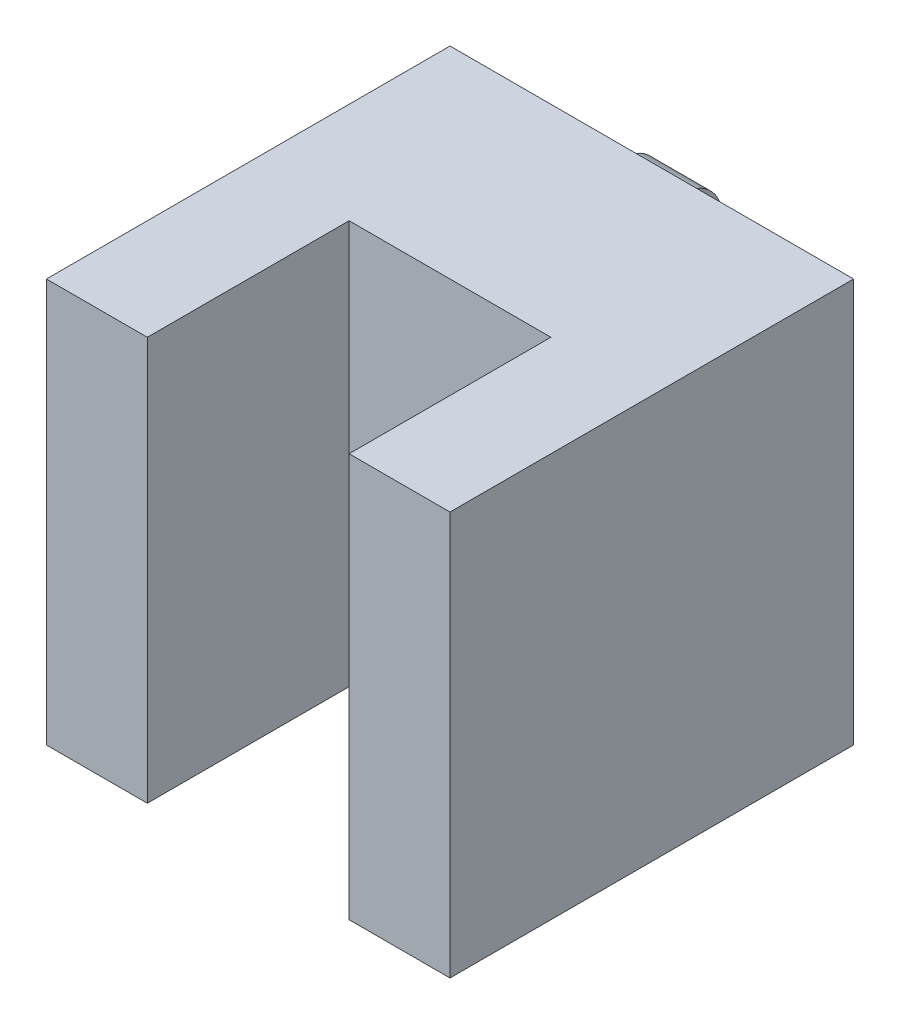
ISO-10303-21;
HEADER;
FILE_DESCRIPTION(('STEP AP214'),'2;1');
FILE_NAME('part.step','',(''),(''),'','','');
FILE_SCHEMA(('AUTOMOTIVE_DESIGN { 1 0 10303 214 1 1 1 1 }'));
ENDSEC;
DATA;
#1=APPLICATION_CONTEXT('core data for automotive mechanical design processes');
#2=APPLICATION_PROTOCOL_DEFINITION('international standard','automotive_design',2000,#1);
#3=PRODUCT_CONTEXT('',#1,'mechanical');
#4=PRODUCT('Part','Part','',(#3));
#5=PRODUCT_RELATED_PRODUCT_CATEGORY('part','',(#4));
#6=PRODUCT_DEFINITION_FORMATION('','',#4);
#7=PRODUCT_DEFINITION_CONTEXT('part definition',#1,'design');
#8=PRODUCT_DEFINITION('design','',#6,#7);
#9=PRODUCT_DEFINITION_SHAPE('','',#8);
#10=(LENGTH_UNIT() NAMED_UNIT(*) SI_UNIT(.MILLI.,.METRE.));
#11=(NAMED_UNIT(*) PLANE_ANGLE_UNIT() SI_UNIT($,.RADIAN.));
#12=(NAMED_UNIT(*) SI_UNIT($,.STERADIAN.) SOLID_ANGLE_UNIT());
#13=UNCERTAINTY_MEASURE_WITH_UNIT(LENGTH_MEASURE(1.E-05),#10,'distance_accuracy_value','');
#14=(GEOMETRIC_REPRESENTATION_CONTEXT(3) GLOBAL_UNCERTAINTY_ASSIGNED_CONTEXT((#13)) GLOBAL_UNIT_ASSIGNED_CONTEXT((#10,
#11,#12)) REPRESENTATION_CONTEXT('',''));
#15=CARTESIAN_POINT('',(0.,0.,0.));
#16=DIRECTION('',(0.,0.,1.));
#17=DIRECTION('',(1.,0.,0.));
#18=AXIS2_PLACEMENT_3D('',#15,#16,#17);
#19=CARTESIAN_POINT('',(-5.,20.,-20.));
#20=DIRECTION('',(0.,0.,1.));
#21=DIRECTION('',(1.,0.,0.));
#22=AXIS2_PLACEMENT_3D('',#19,#20,#21);
#23=PLANE('',#22);
#24=DIRECTION('',(0.,-1.,0.));
#25=VECTOR('',#24,1.);
#26=CARTESIAN_POINT('',(3.5,18.9127443644208,-20.));
#27=LINE('',#26,#25);
#28=CARTESIAN_POINT('',(3.5,19.4127443644208,-20.));
#29=VERTEX_POINT('',#28);
#30=CARTESIAN_POINT('',(3.5,18.9127443644208,-20.));
#31=VERTEX_POINT('',#30);
#32=EDGE_CURVE('E137',#29,#31,#27,.T.);
#33=ORIENTED_EDGE('',*,*,#32,.T.);
#34=DIRECTION('',(1.,0.,0.));
#35=VECTOR('',#34,1.);
#36=CARTESIAN_POINT('',(3.5,18.9127443644208,-20.));
#37=LINE('',#36,#35);
#38=CARTESIAN_POINT('',(6.5,18.9127443644208,-20.));
#39=VERTEX_POINT('',#38);
#40=EDGE_CURVE('E128',#31,#39,#37,.T.);
#41=ORIENTED_EDGE('',*,*,#40,.T.);
#42=DIRECTION('',(0.,-1.,0.));
#43=VECTOR('',#42,1.);
#44=CARTESIAN_POINT('',(6.5,18.9127443644208,-20.));
#45=LINE('',#44,#43);
#46=CARTESIAN_POINT('',(6.5,19.4127443644208,-20.));
#47=VERTEX_POINT('',#46);
#48=EDGE_CURVE('E120',#47,#39,#45,.T.);
#49=ORIENTED_EDGE('',*,*,#48,.F.);
#50=DIRECTION('',(1.,0.,0.));
#51=VECTOR('',#50,1.);
#52=CARTESIAN_POINT('',(3.5,19.4127443644208,-20.));
#53=LINE('',#52,#51);
#54=EDGE_CURVE('E138',#29,#47,#53,.T.);
#55=ORIENTED_EDGE('',*,*,#54,.F.);
#56=EDGE_LOOP('',(#33,#41,#49,#55));
#57=FACE_BOUND('',#56,.T.);
#58=DIRECTION('',(-1.,0.,0.));
#59=VECTOR('',#58,1.);
#60=CARTESIAN_POINT('',(-5.,0.,-20.));
#61=LINE('',#60,#59);
#62=CARTESIAN_POINT('',(15.,0.,-20.));
#63=VERTEX_POINT('',#62);
#64=CARTESIAN_POINT('',(-5.,0.,-20.));
#65=VERTEX_POINT('',#64);
#66=EDGE_CURVE('E178',#63,#65,#61,.T.);
#67=ORIENTED_EDGE('',*,*,#66,.T.);
#68=DIRECTION('',(0.,-1.,0.));
#69=VECTOR('',#68,1.);
#70=CARTESIAN_POINT('',(-5.,20.,-20.));
#71=LINE('',#70,#69);
#72=CARTESIAN_POINT('',(-5.,20.,-20.));
#73=VERTEX_POINT('',#72);
#74=EDGE_CURVE('E183',#73,#65,#71,.T.);
#75=ORIENTED_EDGE('',*,*,#74,.F.);
#76=DIRECTION('',(-1.,0.,0.));
#77=VECTOR('',#76,1.);
#78=CARTESIAN_POINT('',(-5.,20.,-20.));
#79=LINE('',#78,#77);
#80=CARTESIAN_POINT('',(15.,20.,-20.));
#81=VERTEX_POINT('',#80);
#82=EDGE_CURVE('E160',#81,#73,#79,.T.);
#83=ORIENTED_EDGE('',*,*,#82,.F.);
#84=DIRECTION('',(0.,-1.,0.));
#85=VECTOR('',#84,1.);
#86=CARTESIAN_POINT('',(15.,20.,-20.));
#87=LINE('',#86,#85);
#88=EDGE_CURVE('E186',#81,#63,#87,.T.);
#89=ORIENTED_EDGE('',*,*,#88,.T.);
#90=EDGE_LOOP('',(#67,#75,#83,#89));
#91=FACE_BOUND('',#90,.T.);
#92=DIRECTION('',(0.,-1.,0.));
#93=VECTOR('',#92,1.);
#94=CARTESIAN_POINT('',(3.5,15.9127443644208,-20.));
#95=LINE('',#94,#93);
#96=CARTESIAN_POINT('',(3.5,15.9127443644208,-20.));
#97=VERTEX_POINT('',#96);
#98=CARTESIAN_POINT('',(3.5,15.4127443644208,-20.));
#99=VERTEX_POINT('',#98);
#100=EDGE_CURVE('E142',#97,#99,#95,.T.);
#101=ORIENTED_EDGE('',*,*,#100,.T.);
#102=DIRECTION('',(1.,0.,0.));
#103=VECTOR('',#102,1.);
#104=CARTESIAN_POINT('',(3.5,15.4127443644208,-20.));
#105=LINE('',#104,#103);
#106=CARTESIAN_POINT('',(6.5,15.4127443644208,-20.));
#107=VERTEX_POINT('',#106);
#108=EDGE_CURVE('E140',#99,#107,#105,.T.);
#109=ORIENTED_EDGE('',*,*,#108,.T.);
#110=DIRECTION('',(0.,-1.,0.));
#111=VECTOR('',#110,1.);
#112=CARTESIAN_POINT('',(6.5,15.9127443644208,-20.));
#113=LINE('',#112,#111);
#114=CARTESIAN_POINT('',(6.5,15.9127443644208,-20.));
#115=VERTEX_POINT('',#114);
#116=EDGE_CURVE('E133',#115,#107,#113,.T.);
#117=ORIENTED_EDGE('',*,*,#116,.F.);
#118=DIRECTION('',(1.,0.,0.));
#119=VECTOR('',#118,1.);
#120=CARTESIAN_POINT('',(3.5,15.9127443644208,-20.));
#121=LINE('',#120,#119);
#122=EDGE_CURVE('E131',#97,#115,#121,.T.);
#123=ORIENTED_EDGE('',*,*,#122,.F.);
#124=EDGE_LOOP('',(#101,#109,#117,#123));
#125=FACE_BOUND('',#124,.T.);
#126=ADVANCED_FACE('F34',(#57,#91,#125),#23,.F.);
#127=CARTESIAN_POINT('',(0.,20.,0.));
#128=DIRECTION('',(0.,0.,-1.));
#129=DIRECTION('',(-1.,0.,0.));
#130=AXIS2_PLACEMENT_3D('',#127,#128,#129);
#131=PLANE('',#130);
#132=DIRECTION('',(1.,0.,0.));
#133=VECTOR('',#132,1.);
#134=CARTESIAN_POINT('',(0.,0.,0.));
#135=LINE('',#134,#133);
#136=CARTESIAN_POINT('',(-5.,0.,0.));
#137=VERTEX_POINT('',#136);
#138=CARTESIAN_POINT('',(0.,0.,0.));
#139=VERTEX_POINT('',#138);
#140=EDGE_CURVE('E165',#137,#139,#135,.T.);
#141=ORIENTED_EDGE('',*,*,#140,.T.);
#142=DIRECTION('',(0.,-1.,0.));
#143=VECTOR('',#142,1.);
#144=CARTESIAN_POINT('',(0.,20.,0.));
#145=LINE('',#144,#143);
#146=CARTESIAN_POINT('',(0.,20.,0.));
#147=VERTEX_POINT('',#146);
#148=EDGE_CURVE('E11',#147,#139,#145,.T.);
#149=ORIENTED_EDGE('',*,*,#148,.F.);
#150=DIRECTION('',(1.,0.,0.));
#151=VECTOR('',#150,1.);
#152=CARTESIAN_POINT('',(0.,20.,0.));
#153=LINE('',#152,#151);
#154=CARTESIAN_POINT('',(-5.,20.,0.));
#155=VERTEX_POINT('',#154);
#156=EDGE_CURVE('E146',#155,#147,#153,.T.);
#157=ORIENTED_EDGE('',*,*,#156,.F.);
#158=DIRECTION('',(0.,-1.,0.));
#159=VECTOR('',#158,1.);
#160=CARTESIAN_POINT('',(-5.,20.,0.));
#161=LINE('',#160,#159);
#162=EDGE_CURVE('E164',#155,#137,#161,.T.);
#163=ORIENTED_EDGE('',*,*,#162,.T.);
#164=EDGE_LOOP('',(#141,#149,#157,#163));
#165=FACE_BOUND('',#164,.T.);
#166=ADVANCED_FACE('F36',(#165),#131,.F.);
#167=CARTESIAN_POINT('',(0.,20.,0.));
#168=DIRECTION('',(-1.,0.,0.));
#169=DIRECTION('',(0.,0.,1.));
#170=AXIS2_PLACEMENT_3D('',#167,#168,#169);
#171=PLANE('',#170);
#172=DIRECTION('',(0.,0.,-1.));
#173=VECTOR('',#172,1.);
#174=CARTESIAN_POINT('',(0.,0.,0.));
#175=LINE('',#174,#173);
#176=CARTESIAN_POINT('',(0.,0.,-10.));
#177=VERTEX_POINT('',#176);
#178=EDGE_CURVE('E168',#139,#177,#175,.T.);
#179=ORIENTED_EDGE('',*,*,#178,.T.);
#180=DIRECTION('',(0.,-1.,0.));
#181=VECTOR('',#180,1.);
#182=CARTESIAN_POINT('',(0.,20.,-10.));
#183=LINE('',#182,#181);
#184=CARTESIAN_POINT('',(0.,20.,-10.));
#185=VERTEX_POINT('',#184);
#186=EDGE_CURVE('E42',#185,#177,#183,.T.);
#187=ORIENTED_EDGE('',*,*,#186,.F.);
#188=DIRECTION('',(0.,0.,-1.));
#189=VECTOR('',#188,1.);
#190=CARTESIAN_POINT('',(0.,20.,0.));
#191=LINE('',#190,#189);
#192=EDGE_CURVE('E149',#147,#185,#191,.T.);
#193=ORIENTED_EDGE('',*,*,#192,.F.);
#194=ORIENTED_EDGE('',*,*,#148,.T.);
#195=EDGE_LOOP('',(#179,#187,#193,#194));
#196=FACE_BOUND('',#195,.T.);
#197=ADVANCED_FACE('F225',(#196),#171,.F.);
#198=CARTESIAN_POINT('',(0.,20.,-10.));
#199=DIRECTION('',(0.,0.,-1.));
#200=DIRECTION('',(-1.,0.,0.));
#201=AXIS2_PLACEMENT_3D('',#198,#199,#200);
#202=PLANE('',#201);
#203=DIRECTION('',(1.,0.,0.));
#204=VECTOR('',#203,1.);
#205=CARTESIAN_POINT('',(0.,0.,-10.));
#206=LINE('',#205,#204);
#207=CARTESIAN_POINT('',(10.,0.,-10.));
#208=VERTEX_POINT('',#207);
#209=EDGE_CURVE('E170',#177,#208,#206,.T.);
#210=ORIENTED_EDGE('',*,*,#209,.T.);
#211=DIRECTION('',(0.,-1.,0.));
#212=VECTOR('',#211,1.);
#213=CARTESIAN_POINT('',(10.,20.,-10.));
#214=LINE('',#213,#212);
#215=CARTESIAN_POINT('',(10.,20.,-10.));
#216=VERTEX_POINT('',#215);
#217=EDGE_CURVE('E195',#216,#208,#214,.T.);
#218=ORIENTED_EDGE('',*,*,#217,.F.);
#219=DIRECTION('',(1.,0.,0.));
#220=VECTOR('',#219,1.);
#221=CARTESIAN_POINT('',(0.,20.,-10.));
#222=LINE('',#221,#220);
#223=EDGE_CURVE('E152',#185,#216,#222,.T.);
#224=ORIENTED_EDGE('',*,*,#223,.F.);
#225=ORIENTED_EDGE('',*,*,#186,.T.);
#226=EDGE_LOOP('',(#210,#218,#224,#225));
#227=FACE_BOUND('',#226,.T.);
#228=ADVANCED_FACE('F202',(#227),#202,.F.);
#229=CARTESIAN_POINT('',(10.,20.,-10.));
#230=DIRECTION('',(1.,0.,0.));
#231=DIRECTION('',(0.,0.,-1.));
#232=AXIS2_PLACEMENT_3D('',#229,#230,#231);
#233=PLANE('',#232);
#234=DIRECTION('',(0.,0.,1.));
#235=VECTOR('',#234,1.);
#236=CARTESIAN_POINT('',(10.,0.,-10.));
#237=LINE('',#236,#235);
#238=CARTESIAN_POINT('',(10.,0.,0.));
#239=VERTEX_POINT('',#238);
#240=EDGE_CURVE('E172',#208,#239,#237,.T.);
#241=ORIENTED_EDGE('',*,*,#240,.T.);
#242=DIRECTION('',(0.,-1.,0.));
#243=VECTOR('',#242,1.);
#244=CARTESIAN_POINT('',(10.,20.,0.));
#245=LINE('',#244,#243);
#246=CARTESIAN_POINT('',(10.,20.,0.));
#247=VERTEX_POINT('',#246);
#248=EDGE_CURVE('E192',#247,#239,#245,.T.);
#249=ORIENTED_EDGE('',*,*,#248,.F.);
#250=DIRECTION('',(0.,0.,1.));
#251=VECTOR('',#250,1.);
#252=CARTESIAN_POINT('',(10.,20.,-10.));
#253=LINE('',#252,#251);
#254=EDGE_CURVE('E154',#216,#247,#253,.T.);
#255=ORIENTED_EDGE('',*,*,#254,.F.);
#256=ORIENTED_EDGE('',*,*,#217,.T.);
#257=EDGE_LOOP('',(#241,#249,#255,#256));
#258=FACE_BOUND('',#257,.T.);
#259=ADVANCED_FACE('F213',(#258),#233,.F.);
#260=CARTESIAN_POINT('',(10.,20.,0.));
#261=DIRECTION('',(0.,0.,-1.));
#262=DIRECTION('',(-1.,0.,0.));
#263=AXIS2_PLACEMENT_3D('',#260,#261,#262);
#264=PLANE('',#263);
#265=DIRECTION('',(1.,0.,0.));
#266=VECTOR('',#265,1.);
#267=CARTESIAN_POINT('',(10.,0.,0.));
#268=LINE('',#267,#266);
#269=CARTESIAN_POINT('',(15.,0.,0.));
#270=VERTEX_POINT('',#269);
#271=EDGE_CURVE('E174',#239,#270,#268,.T.);
#272=ORIENTED_EDGE('',*,*,#271,.T.);
#273=DIRECTION('',(0.,-1.,0.));
#274=VECTOR('',#273,1.);
#275=CARTESIAN_POINT('',(15.,20.,0.));
#276=LINE('',#275,#274);
#277=CARTESIAN_POINT('',(15.,20.,0.));
#278=VERTEX_POINT('',#277);
#279=EDGE_CURVE('E189',#278,#270,#276,.T.);
#280=ORIENTED_EDGE('',*,*,#279,.F.);
#281=DIRECTION('',(1.,0.,0.));
#282=VECTOR('',#281,1.);
#283=CARTESIAN_POINT('',(10.,20.,0.));
#284=LINE('',#283,#282);
#285=EDGE_CURVE('E156',#247,#278,#284,.T.);
#286=ORIENTED_EDGE('',*,*,#285,.F.);
#287=ORIENTED_EDGE('',*,*,#248,.T.);
#288=EDGE_LOOP('',(#272,#280,#286,#287));
#289=FACE_BOUND('',#288,.T.);
#290=ADVANCED_FACE('F217',(#289),#264,.F.);
#291=CARTESIAN_POINT('',(15.,20.,0.));
#292=DIRECTION('',(-1.,0.,0.));
#293=DIRECTION('',(0.,0.,1.));
#294=AXIS2_PLACEMENT_3D('',#291,#292,#293);
#295=PLANE('',#294);
#296=DIRECTION('',(0.,0.,-1.));
#297=VECTOR('',#296,1.);
#298=CARTESIAN_POINT('',(15.,0.,0.));
#299=LINE('',#298,#297);
#300=EDGE_CURVE('E176',#270,#63,#299,.T.);
#301=ORIENTED_EDGE('',*,*,#300,.T.);
#302=ORIENTED_EDGE('',*,*,#88,.F.);
#303=DIRECTION('',(0.,0.,-1.));
#304=VECTOR('',#303,1.);
#305=CARTESIAN_POINT('',(15.,20.,0.));
#306=LINE('',#305,#304);
#307=EDGE_CURVE('E158',#278,#81,#306,.T.);
#308=ORIENTED_EDGE('',*,*,#307,.F.);
#309=ORIENTED_EDGE('',*,*,#279,.T.);
#310=EDGE_LOOP('',(#301,#302,#308,#309));
#311=FACE_BOUND('',#310,.T.);
#312=ADVANCED_FACE('F237',(#311),#295,.F.);
#313=CARTESIAN_POINT('',(-5.,20.,0.));
#314=DIRECTION('',(1.,0.,0.));
#315=DIRECTION('',(0.,0.,-1.));
#316=AXIS2_PLACEMENT_3D('',#313,#314,#315);
#317=PLANE('',#316);
#318=DIRECTION('',(0.,0.,1.));
#319=VECTOR('',#318,1.);
#320=CARTESIAN_POINT('',(-5.,0.,0.));
#321=LINE('',#320,#319);
#322=EDGE_CURVE('E150',#65,#137,#321,.T.);
#323=ORIENTED_EDGE('',*,*,#322,.T.);
#324=ORIENTED_EDGE('',*,*,#162,.F.);
#325=DIRECTION('',(0.,0.,1.));
#326=VECTOR('',#325,1.);
#327=CARTESIAN_POINT('',(-5.,20.,0.));
#328=LINE('',#327,#326);
#329=EDGE_CURVE('E162',#73,#155,#328,.T.);
#330=ORIENTED_EDGE('',*,*,#329,.F.);
#331=ORIENTED_EDGE('',*,*,#74,.T.);
#332=EDGE_LOOP('',(#323,#324,#330,#331));
#333=FACE_BOUND('',#332,.T.);
#334=ADVANCED_FACE('F231',(#333),#317,.F.);
#335=CARTESIAN_POINT('',(0.,20.,0.));
#336=DIRECTION('',(0.,-1.,0.));
#337=DIRECTION('',(0.,0.,-1.));
#338=AXIS2_PLACEMENT_3D('',#335,#336,#337);
#339=PLANE('',#338);
#340=ORIENTED_EDGE('',*,*,#156,.T.);
#341=ORIENTED_EDGE('',*,*,#192,.T.);
#342=ORIENTED_EDGE('',*,*,#223,.T.);
#343=ORIENTED_EDGE('',*,*,#254,.T.);
#344=ORIENTED_EDGE('',*,*,#285,.T.);
#345=ORIENTED_EDGE('',*,*,#307,.T.);
#346=ORIENTED_EDGE('',*,*,#82,.T.);
#347=ORIENTED_EDGE('',*,*,#329,.T.);
#348=EDGE_LOOP('',(#340,#341,#342,#343,#344,#345,#346,#347));
#349=FACE_BOUND('',#348,.T.);
#350=ADVANCED_FACE('F221',(#349),#339,.F.);
#351=CARTESIAN_POINT('',(0.,0.,0.));
#352=DIRECTION('',(0.,-1.,0.));
#353=DIRECTION('',(0.,0.,-1.));
#354=AXIS2_PLACEMENT_3D('',#351,#352,#353);
#355=PLANE('',#354);
#356=ORIENTED_EDGE('',*,*,#140,.F.);
#357=ORIENTED_EDGE('',*,*,#322,.F.);
#358=ORIENTED_EDGE('',*,*,#66,.F.);
#359=ORIENTED_EDGE('',*,*,#300,.F.);
#360=ORIENTED_EDGE('',*,*,#271,.F.);
#361=ORIENTED_EDGE('',*,*,#240,.F.);
#362=ORIENTED_EDGE('',*,*,#209,.F.);
#363=ORIENTED_EDGE('',*,*,#178,.F.);
#364=EDGE_LOOP('',(#356,#357,#358,#359,#360,#361,#362,#363));
#365=FACE_BOUND('',#364,.T.);
#366=ADVANCED_FACE('F208',(#365),#355,.T.);
#367=CARTESIAN_POINT('',(3.5,17.4127443644208,-20.));
#368=DIRECTION('',(1.,0.,0.));
#369=DIRECTION('',(0.,0.,-1.));
#370=AXIS2_PLACEMENT_3D('',#367,#368,#369);
#371=CYLINDRICAL_SURFACE('',#370,2.);
#372=ORIENTED_EDGE('',*,*,#54,.T.);
#373=CARTESIAN_POINT('',(6.5,17.4127443644208,-20.));
#374=DIRECTION('',(1.,0.,0.));
#375=DIRECTION('',(0.,0.,-1.));
#376=AXIS2_PLACEMENT_3D('',#373,#374,#375);
#377=CIRCLE('',#376,2.);
#378=EDGE_CURVE('E54',#107,#47,#377,.T.);
#379=ORIENTED_EDGE('',*,*,#378,.F.);
#380=ORIENTED_EDGE('',*,*,#108,.F.);
#381=CARTESIAN_POINT('',(3.5,17.4127443644208,-20.));
#382=DIRECTION('',(1.,0.,0.));
#383=DIRECTION('',(0.,0.,-1.));
#384=AXIS2_PLACEMENT_3D('',#381,#382,#383);
#385=CIRCLE('',#384,2.);
#386=EDGE_CURVE('E355',#99,#29,#385,.T.);
#387=ORIENTED_EDGE('',*,*,#386,.T.);
#388=EDGE_LOOP('',(#372,#379,#380,#387));
#389=FACE_BOUND('',#388,.T.);
#390=ADVANCED_FACE('F254',(#389),#371,.T.);
#391=CARTESIAN_POINT('',(3.5,17.4127443644208,-20.));
#392=DIRECTION('',(1.,0.,0.));
#393=DIRECTION('',(0.,0.,-1.));
#394=AXIS2_PLACEMENT_3D('',#391,#392,#393);
#395=CYLINDRICAL_SURFACE('',#394,1.5);
#396=ORIENTED_EDGE('',*,*,#122,.T.);
#397=CARTESIAN_POINT('',(6.5,17.4127443644208,-20.));
#398=DIRECTION('',(-1.,0.,0.));
#399=DIRECTION('',(0.,0.,-1.));
#400=AXIS2_PLACEMENT_3D('',#397,#398,#399);
#401=CIRCLE('',#400,1.5);
#402=EDGE_CURVE('E49',#39,#115,#401,.T.);
#403=ORIENTED_EDGE('',*,*,#402,.F.);
#404=ORIENTED_EDGE('',*,*,#40,.F.);
#405=CARTESIAN_POINT('',(3.5,17.4127443644208,-20.));
#406=DIRECTION('',(-1.,0.,0.));
#407=DIRECTION('',(0.,0.,-1.));
#408=AXIS2_PLACEMENT_3D('',#405,#406,#407);
#409=CIRCLE('',#408,1.5);
#410=EDGE_CURVE('E359',#31,#97,#409,.T.);
#411=ORIENTED_EDGE('',*,*,#410,.T.);
#412=EDGE_LOOP('',(#396,#403,#404,#411));
#413=FACE_BOUND('',#412,.T.);
#414=ADVANCED_FACE('F127',(#413),#395,.F.);
#415=CARTESIAN_POINT('',(3.5,17.4127443644208,-20.));
#416=DIRECTION('',(1.,0.,0.));
#417=DIRECTION('',(0.,0.,-1.));
#418=AXIS2_PLACEMENT_3D('',#415,#416,#417);
#419=PLANE('',#418);
#420=ORIENTED_EDGE('',*,*,#386,.F.);
#421=ORIENTED_EDGE('',*,*,#100,.F.);
#422=ORIENTED_EDGE('',*,*,#410,.F.);
#423=ORIENTED_EDGE('',*,*,#32,.F.);
#424=EDGE_LOOP('',(#420,#421,#422,#423));
#425=FACE_BOUND('',#424,.T.);
#426=ADVANCED_FACE('F262',(#425),#419,.F.);
#427=CARTESIAN_POINT('',(6.5,17.4127443644208,-20.));
#428=DIRECTION('',(1.,0.,0.));
#429=DIRECTION('',(0.,0.,-1.));
#430=AXIS2_PLACEMENT_3D('',#427,#428,#429);
#431=PLANE('',#430);
#432=ORIENTED_EDGE('',*,*,#378,.T.);
#433=ORIENTED_EDGE('',*,*,#48,.T.);
#434=ORIENTED_EDGE('',*,*,#402,.T.);
#435=ORIENTED_EDGE('',*,*,#116,.T.);
#436=EDGE_LOOP('',(#432,#433,#434,#435));
#437=FACE_BOUND('',#436,.T.);
#438=ADVANCED_FACE('F121',(#437),#431,.T.);
#439=CLOSED_SHELL('',(#126,#166,#197,#228,#259,#290,#312,#334,#350,#366,#390,#414,#426,#438));
#440=MANIFOLD_SOLID_BREP('B2',#439);
#441=ADVANCED_BREP_SHAPE_REPRESENTATION('',(#18,#440),#14);
#442=SHAPE_DEFINITION_REPRESENTATION(#9,#441);
ENDSEC;
END-ISO-10303-21;
